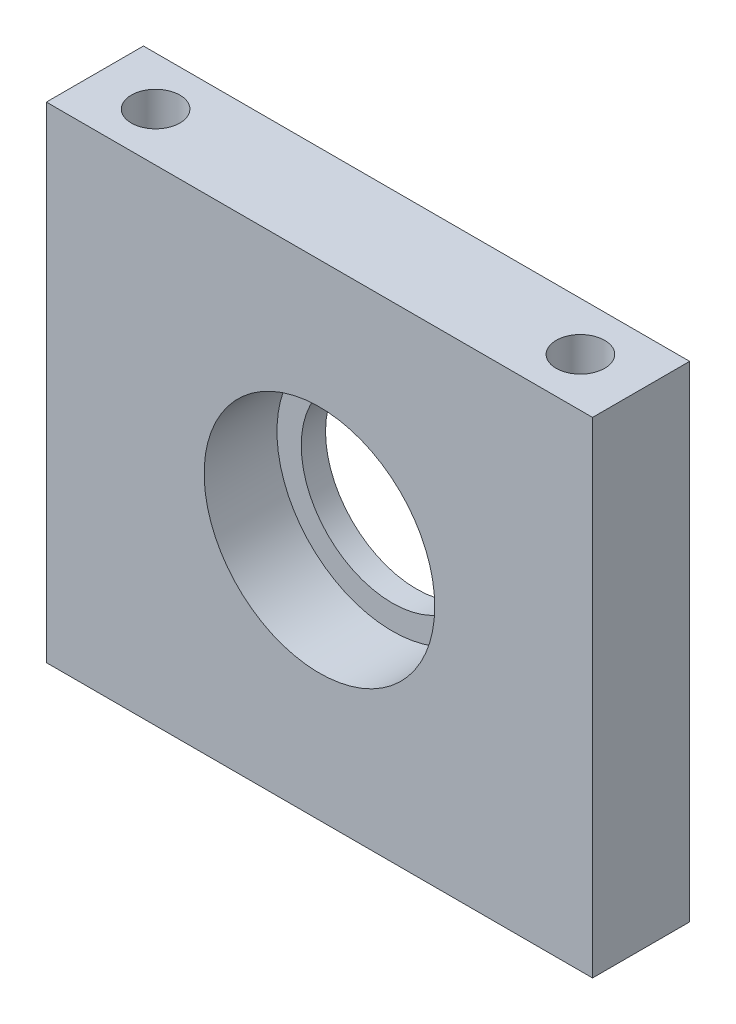
ISO-10303-21;
HEADER;
FILE_DESCRIPTION(('STEP AP214'),'2;1');
FILE_NAME('part.step','',(''),(''),'','','');
FILE_SCHEMA(('AUTOMOTIVE_DESIGN { 1 0 10303 214 1 1 1 1 }'));
ENDSEC;
DATA;
#1=APPLICATION_CONTEXT('core data for automotive mechanical design processes');
#2=APPLICATION_PROTOCOL_DEFINITION('international standard','automotive_design',2000,#1);
#3=PRODUCT_CONTEXT('',#1,'mechanical');
#4=PRODUCT('Part','Part','',(#3));
#5=PRODUCT_RELATED_PRODUCT_CATEGORY('part','',(#4));
#6=PRODUCT_DEFINITION_FORMATION('','',#4);
#7=PRODUCT_DEFINITION_CONTEXT('part definition',#1,'design');
#8=PRODUCT_DEFINITION('design','',#6,#7);
#9=PRODUCT_DEFINITION_SHAPE('','',#8);
#10=(LENGTH_UNIT() NAMED_UNIT(*) SI_UNIT(.MILLI.,.METRE.));
#11=(NAMED_UNIT(*) PLANE_ANGLE_UNIT() SI_UNIT($,.RADIAN.));
#12=(NAMED_UNIT(*) SI_UNIT($,.STERADIAN.) SOLID_ANGLE_UNIT());
#13=UNCERTAINTY_MEASURE_WITH_UNIT(LENGTH_MEASURE(1.E-05),#10,'distance_accuracy_value','');
#14=(GEOMETRIC_REPRESENTATION_CONTEXT(3) GLOBAL_UNCERTAINTY_ASSIGNED_CONTEXT((#13)) GLOBAL_UNIT_ASSIGNED_CONTEXT((#10,
#11,#12)) REPRESENTATION_CONTEXT('',''));
#15=CARTESIAN_POINT('',(0.,0.,0.));
#16=DIRECTION('',(0.,0.,1.));
#17=DIRECTION('',(1.,0.,0.));
#18=AXIS2_PLACEMENT_3D('',#15,#16,#17);
#19=CARTESIAN_POINT('',(0.,0.,0.));
#20=DIRECTION('',(0.,0.,1.));
#21=DIRECTION('',(1.,0.,0.));
#22=AXIS2_PLACEMENT_3D('',#19,#20,#21);
#23=CYLINDRICAL_SURFACE('',#22,7.5);
#24=CARTESIAN_POINT('',(0.,0.,0.));
#25=DIRECTION('',(0.,0.,1.));
#26=DIRECTION('',(1.,0.,0.));
#27=AXIS2_PLACEMENT_3D('',#24,#25,#26);
#28=CIRCLE('',#27,7.5);
#29=CARTESIAN_POINT('',(7.5,0.,0.));
#30=VERTEX_POINT('',#29);
#31=EDGE_CURVE('E106',#30,#30,#28,.T.);
#32=ORIENTED_EDGE('',*,*,#31,.F.);
#33=EDGE_LOOP('',(#32));
#34=FACE_BOUND('',#33,.T.);
#35=CARTESIAN_POINT('',(0.,0.,2.));
#36=DIRECTION('',(0.,0.,1.));
#37=DIRECTION('',(1.,0.,0.));
#38=AXIS2_PLACEMENT_3D('',#35,#36,#37);
#39=CIRCLE('',#38,7.5);
#40=CARTESIAN_POINT('',(7.5,0.,2.));
#41=VERTEX_POINT('',#40);
#42=EDGE_CURVE('E41',#41,#41,#39,.F.);
#43=ORIENTED_EDGE('',*,*,#42,.F.);
#44=EDGE_LOOP('',(#43));
#45=FACE_BOUND('',#44,.T.);
#46=ADVANCED_FACE('F37',(#34,#45),#23,.F.);
#47=CARTESIAN_POINT('',(22.5,-20.,8.));
#48=DIRECTION('',(-1.,0.,0.));
#49=DIRECTION('',(0.,0.,1.));
#50=AXIS2_PLACEMENT_3D('',#47,#48,#49);
#51=PLANE('',#50);
#52=DIRECTION('',(0.,1.,0.));
#53=VECTOR('',#52,1.);
#54=CARTESIAN_POINT('',(22.5,-20.,0.));
#55=LINE('',#54,#53);
#56=CARTESIAN_POINT('',(22.5,-20.,0.));
#57=VERTEX_POINT('',#56);
#58=CARTESIAN_POINT('',(22.5,20.,0.));
#59=VERTEX_POINT('',#58);
#60=EDGE_CURVE('E103',#57,#59,#55,.T.);
#61=ORIENTED_EDGE('',*,*,#60,.T.);
#62=DIRECTION('',(0.,0.,-1.));
#63=VECTOR('',#62,1.);
#64=CARTESIAN_POINT('',(22.5,20.,8.));
#65=LINE('',#64,#63);
#66=CARTESIAN_POINT('',(22.5,20.,8.));
#67=VERTEX_POINT('',#66);
#68=EDGE_CURVE('E11',#67,#59,#65,.T.);
#69=ORIENTED_EDGE('',*,*,#68,.F.);
#70=DIRECTION('',(0.,1.,0.));
#71=VECTOR('',#70,1.);
#72=CARTESIAN_POINT('',(22.5,-20.,8.));
#73=LINE('',#72,#71);
#74=CARTESIAN_POINT('',(22.5,-20.,8.));
#75=VERTEX_POINT('',#74);
#76=EDGE_CURVE('E90',#75,#67,#73,.T.);
#77=ORIENTED_EDGE('',*,*,#76,.F.);
#78=DIRECTION('',(0.,0.,-1.));
#79=VECTOR('',#78,1.);
#80=CARTESIAN_POINT('',(22.5,-20.,8.));
#81=LINE('',#80,#79);
#82=EDGE_CURVE('E99',#75,#57,#81,.T.);
#83=ORIENTED_EDGE('',*,*,#82,.T.);
#84=EDGE_LOOP('',(#61,#69,#77,#83));
#85=FACE_BOUND('',#84,.T.);
#86=ADVANCED_FACE('F39',(#85),#51,.F.);
#87=CARTESIAN_POINT('',(-22.5,20.,8.));
#88=DIRECTION('',(0.,-1.,0.));
#89=DIRECTION('',(0.,0.,-1.));
#90=AXIS2_PLACEMENT_3D('',#87,#88,#89);
#91=PLANE('',#90);
#92=CARTESIAN_POINT('',(-17.5,20.,4.));
#93=DIRECTION('',(0.,1.,0.));
#94=DIRECTION('',(0.,0.,1.));
#95=AXIS2_PLACEMENT_3D('',#92,#93,#94);
#96=CIRCLE('',#95,2.);
#97=CARTESIAN_POINT('',(-17.5,20.,6.));
#98=VERTEX_POINT('',#97);
#99=EDGE_CURVE('E132',#98,#98,#96,.T.);
#100=ORIENTED_EDGE('',*,*,#99,.F.);
#101=EDGE_LOOP('',(#100));
#102=FACE_BOUND('',#101,.T.);
#103=CARTESIAN_POINT('',(17.5,20.,4.));
#104=DIRECTION('',(0.,1.,0.));
#105=DIRECTION('',(0.,0.,1.));
#106=AXIS2_PLACEMENT_3D('',#103,#104,#105);
#107=CIRCLE('',#106,2.);
#108=CARTESIAN_POINT('',(17.5,20.,6.));
#109=VERTEX_POINT('',#108);
#110=EDGE_CURVE('E126',#109,#109,#107,.T.);
#111=ORIENTED_EDGE('',*,*,#110,.F.);
#112=EDGE_LOOP('',(#111));
#113=FACE_BOUND('',#112,.T.);
#114=DIRECTION('',(-1.,0.,0.));
#115=VECTOR('',#114,1.);
#116=CARTESIAN_POINT('',(-22.5,20.,0.));
#117=LINE('',#116,#115);
#118=CARTESIAN_POINT('',(-22.5,20.,0.));
#119=VERTEX_POINT('',#118);
#120=EDGE_CURVE('E94',#59,#119,#117,.T.);
#121=ORIENTED_EDGE('',*,*,#120,.T.);
#122=DIRECTION('',(0.,0.,-1.));
#123=VECTOR('',#122,1.);
#124=CARTESIAN_POINT('',(-22.5,20.,8.));
#125=LINE('',#124,#123);
#126=CARTESIAN_POINT('',(-22.5,20.,8.));
#127=VERTEX_POINT('',#126);
#128=EDGE_CURVE('E47',#127,#119,#125,.T.);
#129=ORIENTED_EDGE('',*,*,#128,.F.);
#130=DIRECTION('',(-1.,0.,0.));
#131=VECTOR('',#130,1.);
#132=CARTESIAN_POINT('',(-22.5,20.,8.));
#133=LINE('',#132,#131);
#134=EDGE_CURVE('E85',#67,#127,#133,.T.);
#135=ORIENTED_EDGE('',*,*,#134,.F.);
#136=ORIENTED_EDGE('',*,*,#68,.T.);
#137=EDGE_LOOP('',(#121,#129,#135,#136));
#138=FACE_BOUND('',#137,.T.);
#139=ADVANCED_FACE('F93',(#102,#113,#138),#91,.F.);
#140=CARTESIAN_POINT('',(-22.5,-20.,8.));
#141=DIRECTION('',(1.,0.,0.));
#142=DIRECTION('',(0.,0.,-1.));
#143=AXIS2_PLACEMENT_3D('',#140,#141,#142);
#144=PLANE('',#143);
#145=DIRECTION('',(0.,-1.,0.));
#146=VECTOR('',#145,1.);
#147=CARTESIAN_POINT('',(-22.5,-20.,0.));
#148=LINE('',#147,#146);
#149=CARTESIAN_POINT('',(-22.5,-20.,0.));
#150=VERTEX_POINT('',#149);
#151=EDGE_CURVE('E72',#119,#150,#148,.T.);
#152=ORIENTED_EDGE('',*,*,#151,.T.);
#153=DIRECTION('',(0.,0.,-1.));
#154=VECTOR('',#153,1.);
#155=CARTESIAN_POINT('',(-22.5,-20.,8.));
#156=LINE('',#155,#154);
#157=CARTESIAN_POINT('',(-22.5,-20.,8.));
#158=VERTEX_POINT('',#157);
#159=EDGE_CURVE('E95',#158,#150,#156,.T.);
#160=ORIENTED_EDGE('',*,*,#159,.F.);
#161=DIRECTION('',(0.,-1.,0.));
#162=VECTOR('',#161,1.);
#163=CARTESIAN_POINT('',(-22.5,-20.,8.));
#164=LINE('',#163,#162);
#165=EDGE_CURVE('E88',#127,#158,#164,.T.);
#166=ORIENTED_EDGE('',*,*,#165,.F.);
#167=ORIENTED_EDGE('',*,*,#128,.T.);
#168=EDGE_LOOP('',(#152,#160,#166,#167));
#169=FACE_BOUND('',#168,.T.);
#170=ADVANCED_FACE('F97',(#169),#144,.F.);
#171=CARTESIAN_POINT('',(-22.5,-20.,8.));
#172=DIRECTION('',(0.,1.,0.));
#173=DIRECTION('',(0.,0.,1.));
#174=AXIS2_PLACEMENT_3D('',#171,#172,#173);
#175=PLANE('',#174);
#176=CARTESIAN_POINT('',(-17.5,-20.,4.));
#177=DIRECTION('',(0.,1.,0.));
#178=DIRECTION('',(0.,0.,1.));
#179=AXIS2_PLACEMENT_3D('',#176,#177,#178);
#180=CIRCLE('',#179,2.);
#181=CARTESIAN_POINT('',(-17.5,-20.,6.));
#182=VERTEX_POINT('',#181);
#183=EDGE_CURVE('E123',#182,#182,#180,.T.);
#184=ORIENTED_EDGE('',*,*,#183,.T.);
#185=EDGE_LOOP('',(#184));
#186=FACE_BOUND('',#185,.T.);
#187=CARTESIAN_POINT('',(17.5,-20.,4.));
#188=DIRECTION('',(0.,1.,0.));
#189=DIRECTION('',(0.,0.,1.));
#190=AXIS2_PLACEMENT_3D('',#187,#188,#189);
#191=CIRCLE('',#190,2.);
#192=CARTESIAN_POINT('',(17.5,-20.,6.));
#193=VERTEX_POINT('',#192);
#194=EDGE_CURVE('E129',#193,#193,#191,.T.);
#195=ORIENTED_EDGE('',*,*,#194,.T.);
#196=EDGE_LOOP('',(#195));
#197=FACE_BOUND('',#196,.T.);
#198=DIRECTION('',(1.,0.,0.));
#199=VECTOR('',#198,1.);
#200=CARTESIAN_POINT('',(-22.5,-20.,0.));
#201=LINE('',#200,#199);
#202=EDGE_CURVE('E78',#150,#57,#201,.T.);
#203=ORIENTED_EDGE('',*,*,#202,.T.);
#204=ORIENTED_EDGE('',*,*,#82,.F.);
#205=DIRECTION('',(1.,0.,0.));
#206=VECTOR('',#205,1.);
#207=CARTESIAN_POINT('',(-22.5,-20.,8.));
#208=LINE('',#207,#206);
#209=EDGE_CURVE('E55',#158,#75,#208,.T.);
#210=ORIENTED_EDGE('',*,*,#209,.F.);
#211=ORIENTED_EDGE('',*,*,#159,.T.);
#212=EDGE_LOOP('',(#203,#204,#210,#211));
#213=FACE_BOUND('',#212,.T.);
#214=ADVANCED_FACE('F111',(#186,#197,#213),#175,.F.);
#215=CARTESIAN_POINT('',(0.,0.,8.));
#216=DIRECTION('',(0.,0.,-1.));
#217=DIRECTION('',(-1.,0.,0.));
#218=AXIS2_PLACEMENT_3D('',#215,#216,#217);
#219=PLANE('',#218);
#220=CARTESIAN_POINT('',(0.,0.,8.));
#221=DIRECTION('',(0.,0.,1.));
#222=DIRECTION('',(1.,0.,0.));
#223=AXIS2_PLACEMENT_3D('',#220,#221,#222);
#224=CIRCLE('',#223,9.5);
#225=CARTESIAN_POINT('',(9.5,0.,8.));
#226=VERTEX_POINT('',#225);
#227=EDGE_CURVE('E119',#226,#226,#224,.T.);
#228=ORIENTED_EDGE('',*,*,#227,.F.);
#229=EDGE_LOOP('',(#228));
#230=FACE_BOUND('',#229,.T.);
#231=ORIENTED_EDGE('',*,*,#76,.T.);
#232=ORIENTED_EDGE('',*,*,#134,.T.);
#233=ORIENTED_EDGE('',*,*,#165,.T.);
#234=ORIENTED_EDGE('',*,*,#209,.T.);
#235=EDGE_LOOP('',(#231,#232,#233,#234));
#236=FACE_BOUND('',#235,.T.);
#237=ADVANCED_FACE('F86',(#230,#236),#219,.F.);
#238=CARTESIAN_POINT('',(0.,0.,0.));
#239=DIRECTION('',(0.,0.,-1.));
#240=DIRECTION('',(-1.,0.,0.));
#241=AXIS2_PLACEMENT_3D('',#238,#239,#240);
#242=PLANE('',#241);
#243=ORIENTED_EDGE('',*,*,#31,.T.);
#244=EDGE_LOOP('',(#243));
#245=FACE_BOUND('',#244,.T.);
#246=ORIENTED_EDGE('',*,*,#60,.F.);
#247=ORIENTED_EDGE('',*,*,#202,.F.);
#248=ORIENTED_EDGE('',*,*,#151,.F.);
#249=ORIENTED_EDGE('',*,*,#120,.F.);
#250=EDGE_LOOP('',(#246,#247,#248,#249));
#251=FACE_BOUND('',#250,.T.);
#252=ADVANCED_FACE('F114',(#245,#251),#242,.T.);
#253=CARTESIAN_POINT('',(0.,0.,2.));
#254=DIRECTION('',(0.,0.,1.));
#255=DIRECTION('',(1.,0.,0.));
#256=AXIS2_PLACEMENT_3D('',#253,#254,#255);
#257=PLANE('',#256);
#258=CARTESIAN_POINT('',(0.,0.,2.));
#259=DIRECTION('',(0.,0.,1.));
#260=DIRECTION('',(1.,0.,0.));
#261=AXIS2_PLACEMENT_3D('',#258,#259,#260);
#262=CIRCLE('',#261,9.5);
#263=CARTESIAN_POINT('',(9.5,0.,2.));
#264=VERTEX_POINT('',#263);
#265=EDGE_CURVE('E122',#264,#264,#262,.T.);
#266=ORIENTED_EDGE('',*,*,#265,.T.);
#267=EDGE_LOOP('',(#266));
#268=FACE_BOUND('',#267,.T.);
#269=ORIENTED_EDGE('',*,*,#42,.T.);
#270=EDGE_LOOP('',(#269));
#271=FACE_BOUND('',#270,.T.);
#272=ADVANCED_FACE('F158',(#268,#271),#257,.T.);
#273=CARTESIAN_POINT('',(0.,0.,2.));
#274=DIRECTION('',(0.,0.,1.));
#275=DIRECTION('',(1.,0.,0.));
#276=AXIS2_PLACEMENT_3D('',#273,#274,#275);
#277=CYLINDRICAL_SURFACE('',#276,9.5);
#278=ORIENTED_EDGE('',*,*,#265,.F.);
#279=EDGE_LOOP('',(#278));
#280=FACE_BOUND('',#279,.T.);
#281=ORIENTED_EDGE('',*,*,#227,.T.);
#282=EDGE_LOOP('',(#281));
#283=FACE_BOUND('',#282,.T.);
#284=ADVANCED_FACE('F152',(#280,#283),#277,.F.);
#285=CARTESIAN_POINT('',(17.5,-20.,4.));
#286=DIRECTION('',(0.,1.,0.));
#287=DIRECTION('',(0.,0.,1.));
#288=AXIS2_PLACEMENT_3D('',#285,#286,#287);
#289=CYLINDRICAL_SURFACE('',#288,2.);
#290=ORIENTED_EDGE('',*,*,#194,.F.);
#291=EDGE_LOOP('',(#290));
#292=FACE_BOUND('',#291,.T.);
#293=ORIENTED_EDGE('',*,*,#110,.T.);
#294=EDGE_LOOP('',(#293));
#295=FACE_BOUND('',#294,.T.);
#296=ADVANCED_FACE('F143',(#292,#295),#289,.F.);
#297=CARTESIAN_POINT('',(-17.5,-20.,4.));
#298=DIRECTION('',(0.,1.,0.));
#299=DIRECTION('',(0.,0.,1.));
#300=AXIS2_PLACEMENT_3D('',#297,#298,#299);
#301=CYLINDRICAL_SURFACE('',#300,2.);
#302=ORIENTED_EDGE('',*,*,#183,.F.);
#303=EDGE_LOOP('',(#302));
#304=FACE_BOUND('',#303,.T.);
#305=ORIENTED_EDGE('',*,*,#99,.T.);
#306=EDGE_LOOP('',(#305));
#307=FACE_BOUND('',#306,.T.);
#308=ADVANCED_FACE('F140',(#304,#307),#301,.F.);
#309=CLOSED_SHELL('',(#46,#86,#139,#170,#214,#237,#252,#272,#284,#296,#308));
#310=MANIFOLD_SOLID_BREP('B2',#309);
#311=ADVANCED_BREP_SHAPE_REPRESENTATION('',(#18,#310),#14);
#312=SHAPE_DEFINITION_REPRESENTATION(#9,#311);
ENDSEC;
END-ISO-10303-21;
